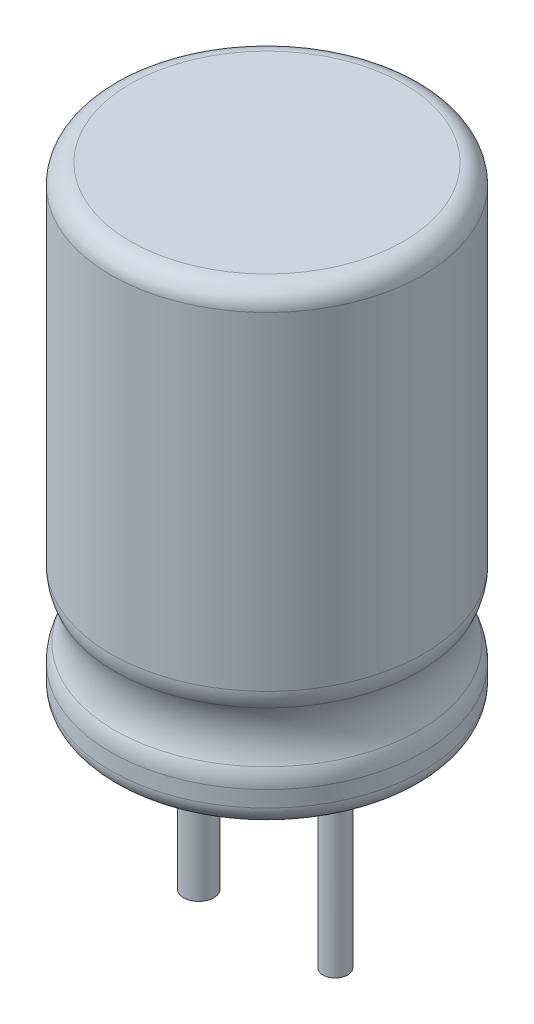
ISO-10303-21;
HEADER;
FILE_DESCRIPTION(('STEP AP214'),'2;1');
FILE_NAME('part.step','',(''),(''),'','','');
FILE_SCHEMA(('AUTOMOTIVE_DESIGN { 1 0 10303 214 1 1 1 1 }'));
ENDSEC;
DATA;
#1=APPLICATION_CONTEXT('core data for automotive mechanical design processes');
#2=APPLICATION_PROTOCOL_DEFINITION('international standard','automotive_design',2000,#1);
#3=PRODUCT_CONTEXT('',#1,'mechanical');
#4=PRODUCT('Part','Part','',(#3));
#5=PRODUCT_RELATED_PRODUCT_CATEGORY('part','',(#4));
#6=PRODUCT_DEFINITION_FORMATION('','',#4);
#7=PRODUCT_DEFINITION_CONTEXT('part definition',#1,'design');
#8=PRODUCT_DEFINITION('design','',#6,#7);
#9=PRODUCT_DEFINITION_SHAPE('','',#8);
#10=(LENGTH_UNIT() NAMED_UNIT(*) SI_UNIT(.MILLI.,.METRE.));
#11=(NAMED_UNIT(*) PLANE_ANGLE_UNIT() SI_UNIT($,.RADIAN.));
#12=(NAMED_UNIT(*) SI_UNIT($,.STERADIAN.) SOLID_ANGLE_UNIT());
#13=UNCERTAINTY_MEASURE_WITH_UNIT(LENGTH_MEASURE(1.E-05),#10,'distance_accuracy_value','');
#14=(GEOMETRIC_REPRESENTATION_CONTEXT(3) GLOBAL_UNCERTAINTY_ASSIGNED_CONTEXT((#13)) GLOBAL_UNIT_ASSIGNED_CONTEXT((#10,
#11,#12)) REPRESENTATION_CONTEXT('',''));
#15=CARTESIAN_POINT('',(0.,0.,0.));
#16=DIRECTION('',(0.,0.,1.));
#17=DIRECTION('',(1.,0.,0.));
#18=AXIS2_PLACEMENT_3D('',#15,#16,#17);
#19=CARTESIAN_POINT('',(0.,12.,0.));
#20=DIRECTION('',(0.,-1.,0.));
#21=DIRECTION('',(0.,0.,-1.));
#22=AXIS2_PLACEMENT_3D('',#19,#20,#21);
#23=CYLINDRICAL_SURFACE('',#22,4.);
#24=CARTESIAN_POINT('',(0.,0.5,0.));
#25=DIRECTION('',(0.,1.,0.));
#26=DIRECTION('',(0.,0.,1.));
#27=AXIS2_PLACEMENT_3D('',#24,#25,#26);
#28=CIRCLE('',#27,4.);
#29=CARTESIAN_POINT('',(0.,0.5,4.));
#30=VERTEX_POINT('',#29);
#31=EDGE_CURVE('E47',#30,#30,#28,.T.);
#32=ORIENTED_EDGE('',*,*,#31,.T.);
#33=EDGE_LOOP('',(#32));
#34=FACE_BOUND('',#33,.T.);
#35=CARTESIAN_POINT('',(0.,0.910275264114831,0.));
#36=DIRECTION('',(0.,-1.,0.));
#37=DIRECTION('',(0.,0.,-1.));
#38=AXIS2_PLACEMENT_3D('',#35,#36,#37);
#39=CIRCLE('',#38,4.);
#40=CARTESIAN_POINT('',(0.,0.910275264114831,-4.));
#41=VERTEX_POINT('',#40);
#42=EDGE_CURVE('E67',#41,#41,#39,.T.);
#43=ORIENTED_EDGE('',*,*,#42,.T.);
#44=EDGE_LOOP('',(#43));
#45=FACE_BOUND('',#44,.T.);
#46=ADVANCED_FACE('F39',(#34,#45),#23,.T.);
#47=CARTESIAN_POINT('',(0.,0.,0.));
#48=DIRECTION('',(0.,1.,0.));
#49=DIRECTION('',(0.,0.,1.));
#50=AXIS2_PLACEMENT_3D('',#47,#48,#49);
#51=PLANE('',#50);
#52=CARTESIAN_POINT('',(0.,0.,0.));
#53=DIRECTION('',(0.,1.,0.));
#54=DIRECTION('',(0.,0.,1.));
#55=AXIS2_PLACEMENT_3D('',#52,#53,#54);
#56=CIRCLE('',#55,3.5);
#57=CARTESIAN_POINT('',(0.,0.,3.5));
#58=VERTEX_POINT('',#57);
#59=EDGE_CURVE('E10',#58,#58,#56,.F.);
#60=ORIENTED_EDGE('',*,*,#59,.T.);
#61=EDGE_LOOP('',(#60));
#62=FACE_BOUND('',#61,.T.);
#63=CARTESIAN_POINT('',(-1.75,0.,0.));
#64=DIRECTION('',(0.,1.,0.));
#65=DIRECTION('',(0.,0.,1.));
#66=AXIS2_PLACEMENT_3D('',#63,#64,#65);
#67=CIRCLE('',#66,0.388464660860843);
#68=CARTESIAN_POINT('',(-1.75,0.,0.388464660860843));
#69=VERTEX_POINT('',#68);
#70=EDGE_CURVE('E79',#69,#69,#67,.F.);
#71=ORIENTED_EDGE('',*,*,#70,.F.);
#72=EDGE_LOOP('',(#71));
#73=FACE_BOUND('',#72,.T.);
#74=CARTESIAN_POINT('',(1.75,0.,0.));
#75=DIRECTION('',(0.,1.,0.));
#76=DIRECTION('',(0.,0.,1.));
#77=AXIS2_PLACEMENT_3D('',#74,#75,#76);
#78=CIRCLE('',#77,0.317566636794891);
#79=CARTESIAN_POINT('',(1.75,0.,0.317566636794891));
#80=VERTEX_POINT('',#79);
#81=EDGE_CURVE('E83',#80,#80,#78,.F.);
#82=ORIENTED_EDGE('',*,*,#81,.F.);
#83=EDGE_LOOP('',(#82));
#84=FACE_BOUND('',#83,.T.);
#85=ADVANCED_FACE('F105',(#62,#73,#84),#51,.F.);
#86=CARTESIAN_POINT('',(1.75,-5.,0.));
#87=DIRECTION('',(0.,1.,0.));
#88=DIRECTION('',(0.,0.,1.));
#89=AXIS2_PLACEMENT_3D('',#86,#87,#88);
#90=CYLINDRICAL_SURFACE('',#89,0.317566636794891);
#91=CARTESIAN_POINT('',(1.75,-5.,0.));
#92=DIRECTION('',(0.,-1.,0.));
#93=DIRECTION('',(0.,0.,-1.));
#94=AXIS2_PLACEMENT_3D('',#91,#92,#93);
#95=CIRCLE('',#94,0.317566636794891);
#96=CARTESIAN_POINT('',(1.75,-5.,-0.317566636794891));
#97=VERTEX_POINT('',#96);
#98=EDGE_CURVE('E87',#97,#97,#95,.T.);
#99=ORIENTED_EDGE('',*,*,#98,.F.);
#100=EDGE_LOOP('',(#99));
#101=FACE_BOUND('',#100,.T.);
#102=ORIENTED_EDGE('',*,*,#81,.T.);
#103=EDGE_LOOP('',(#102));
#104=FACE_BOUND('',#103,.T.);
#105=ADVANCED_FACE('F108',(#101,#104),#90,.T.);
#106=CARTESIAN_POINT('',(1.75,-5.,0.));
#107=DIRECTION('',(0.,-1.,0.));
#108=DIRECTION('',(0.,0.,-1.));
#109=AXIS2_PLACEMENT_3D('',#106,#107,#108);
#110=PLANE('',#109);
#111=ORIENTED_EDGE('',*,*,#98,.T.);
#112=EDGE_LOOP('',(#111));
#113=FACE_BOUND('',#112,.T.);
#114=ADVANCED_FACE('F101',(#113),#110,.T.);
#115=CARTESIAN_POINT('',(-1.75,-5.,0.));
#116=DIRECTION('',(0.,1.,0.));
#117=DIRECTION('',(0.,0.,1.));
#118=AXIS2_PLACEMENT_3D('',#115,#116,#117);
#119=CYLINDRICAL_SURFACE('',#118,0.388464660860843);
#120=CARTESIAN_POINT('',(-1.75,-5.,0.));
#121=DIRECTION('',(0.,-1.,0.));
#122=DIRECTION('',(0.,0.,-1.));
#123=AXIS2_PLACEMENT_3D('',#120,#121,#122);
#124=CIRCLE('',#123,0.388464660860843);
#125=CARTESIAN_POINT('',(-1.75,-5.,-0.388464660860843));
#126=VERTEX_POINT('',#125);
#127=EDGE_CURVE('E91',#126,#126,#124,.T.);
#128=ORIENTED_EDGE('',*,*,#127,.F.);
#129=EDGE_LOOP('',(#128));
#130=FACE_BOUND('',#129,.T.);
#131=ORIENTED_EDGE('',*,*,#70,.T.);
#132=EDGE_LOOP('',(#131));
#133=FACE_BOUND('',#132,.T.);
#134=ADVANCED_FACE('F98',(#130,#133),#119,.T.);
#135=CARTESIAN_POINT('',(-1.75,-5.,0.));
#136=DIRECTION('',(0.,-1.,0.));
#137=DIRECTION('',(0.,0.,-1.));
#138=AXIS2_PLACEMENT_3D('',#135,#136,#137);
#139=PLANE('',#138);
#140=ORIENTED_EDGE('',*,*,#127,.T.);
#141=EDGE_LOOP('',(#140));
#142=FACE_BOUND('',#141,.T.);
#143=ADVANCED_FACE('F96',(#142),#139,.T.);
#144=CARTESIAN_POINT('',(0.,2.,0.));
#145=DIRECTION('',(0.,1.,0.));
#146=DIRECTION('',(0.,0.,1.));
#147=AXIS2_PLACEMENT_3D('',#144,#145,#146);
#148=TOROIDAL_SURFACE('',#147,5.25,1.5);
#149=CARTESIAN_POINT('',(0.,1.3461651584689,0.));
#150=DIRECTION('',(0.,1.,0.));
#151=DIRECTION('',(0.,0.,1.));
#152=AXIS2_PLACEMENT_3D('',#149,#150,#151);
#153=CIRCLE('',#152,3.9);
#154=CARTESIAN_POINT('',(0.,1.3461651584689,3.9));
#155=VERTEX_POINT('',#154);
#156=EDGE_CURVE('E71',#155,#155,#153,.T.);
#157=ORIENTED_EDGE('',*,*,#156,.T.);
#158=EDGE_LOOP('',(#157));
#159=FACE_BOUND('',#158,.T.);
#160=CARTESIAN_POINT('',(0.,2.6538348415311,0.));
#161=DIRECTION('',(0.,-1.,0.));
#162=DIRECTION('',(0.,0.,-1.));
#163=AXIS2_PLACEMENT_3D('',#160,#161,#162);
#164=CIRCLE('',#163,3.9);
#165=CARTESIAN_POINT('',(0.,2.6538348415311,-3.9));
#166=VERTEX_POINT('',#165);
#167=EDGE_CURVE('E75',#166,#166,#164,.T.);
#168=ORIENTED_EDGE('',*,*,#167,.T.);
#169=EDGE_LOOP('',(#168));
#170=FACE_BOUND('',#169,.T.);
#171=ADVANCED_FACE('F139',(#159,#170),#148,.F.);
#172=CARTESIAN_POINT('',(0.,12.,0.));
#173=DIRECTION('',(0.,1.,0.));
#174=DIRECTION('',(0.,0.,1.));
#175=AXIS2_PLACEMENT_3D('',#172,#173,#174);
#176=PLANE('',#175);
#177=CARTESIAN_POINT('',(0.,12.,0.));
#178=DIRECTION('',(0.,1.,0.));
#179=DIRECTION('',(0.,0.,1.));
#180=AXIS2_PLACEMENT_3D('',#177,#178,#179);
#181=CIRCLE('',#180,3.5);
#182=CARTESIAN_POINT('',(0.,12.,3.5));
#183=VERTEX_POINT('',#182);
#184=EDGE_CURVE('E57',#183,#183,#181,.T.);
#185=ORIENTED_EDGE('',*,*,#184,.T.);
#186=EDGE_LOOP('',(#185));
#187=FACE_BOUND('',#186,.T.);
#188=ADVANCED_FACE('F131',(#187),#176,.T.);
#189=CARTESIAN_POINT('',(0.,11.5,0.));
#190=DIRECTION('',(0.,1.,0.));
#191=DIRECTION('',(0.,0.,1.));
#192=AXIS2_PLACEMENT_3D('',#189,#190,#191);
#193=CIRCLE('',#192,4.);
#194=CARTESIAN_POINT('',(0.,11.5,4.));
#195=VERTEX_POINT('',#194);
#196=EDGE_CURVE('E52',#195,#195,#193,.F.);
#197=ORIENTED_EDGE('',*,*,#196,.T.);
#198=EDGE_LOOP('',(#197));
#199=FACE_BOUND('',#198,.T.);
#200=CARTESIAN_POINT('',(0.,3.08972473588517,0.));
#201=DIRECTION('',(0.,1.,0.));
#202=DIRECTION('',(0.,0.,1.));
#203=AXIS2_PLACEMENT_3D('',#200,#201,#202);
#204=CIRCLE('',#203,4.);
#205=CARTESIAN_POINT('',(0.,3.08972473588517,4.));
#206=VERTEX_POINT('',#205);
#207=EDGE_CURVE('E63',#206,#206,#204,.T.);
#208=ORIENTED_EDGE('',*,*,#207,.T.);
#209=EDGE_LOOP('',(#208));
#210=FACE_BOUND('',#209,.T.);
#211=ADVANCED_FACE('F124',(#199,#210),#23,.T.);
#212=CARTESIAN_POINT('',(0.,0.910275264114831,0.));
#213=DIRECTION('',(0.,-1.,0.));
#214=DIRECTION('',(0.,0.,-1.));
#215=AXIS2_PLACEMENT_3D('',#212,#213,#214);
#216=TOROIDAL_SURFACE('',#215,3.,1.);
#217=ORIENTED_EDGE('',*,*,#42,.F.);
#218=EDGE_LOOP('',(#217));
#219=FACE_BOUND('',#218,.T.);
#220=ORIENTED_EDGE('',*,*,#156,.F.);
#221=EDGE_LOOP('',(#220));
#222=FACE_BOUND('',#221,.T.);
#223=ADVANCED_FACE('F130',(#219,#222),#216,.T.);
#224=CARTESIAN_POINT('',(0.,3.08972473588517,0.));
#225=DIRECTION('',(0.,1.,0.));
#226=DIRECTION('',(0.,0.,1.));
#227=AXIS2_PLACEMENT_3D('',#224,#225,#226);
#228=TOROIDAL_SURFACE('',#227,3.,1.);
#229=ORIENTED_EDGE('',*,*,#207,.F.);
#230=EDGE_LOOP('',(#229));
#231=FACE_BOUND('',#230,.T.);
#232=ORIENTED_EDGE('',*,*,#167,.F.);
#233=EDGE_LOOP('',(#232));
#234=FACE_BOUND('',#233,.T.);
#235=ADVANCED_FACE('F137',(#231,#234),#228,.T.);
#236=CARTESIAN_POINT('',(0.,11.5,0.));
#237=DIRECTION('',(0.,1.,0.));
#238=DIRECTION('',(0.,0.,1.));
#239=AXIS2_PLACEMENT_3D('',#236,#237,#238);
#240=TOROIDAL_SURFACE('',#239,3.5,0.5);
#241=ORIENTED_EDGE('',*,*,#196,.F.);
#242=EDGE_LOOP('',(#241));
#243=FACE_BOUND('',#242,.T.);
#244=ORIENTED_EDGE('',*,*,#184,.F.);
#245=EDGE_LOOP('',(#244));
#246=FACE_BOUND('',#245,.T.);
#247=ADVANCED_FACE('F147',(#243,#246),#240,.T.);
#248=CARTESIAN_POINT('',(0.,0.5,0.));
#249=DIRECTION('',(0.,1.,0.));
#250=DIRECTION('',(0.,0.,1.));
#251=AXIS2_PLACEMENT_3D('',#248,#249,#250);
#252=TOROIDAL_SURFACE('',#251,3.5,0.5);
#253=ORIENTED_EDGE('',*,*,#59,.F.);
#254=EDGE_LOOP('',(#253));
#255=FACE_BOUND('',#254,.T.);
#256=ORIENTED_EDGE('',*,*,#31,.F.);
#257=EDGE_LOOP('',(#256));
#258=FACE_BOUND('',#257,.T.);
#259=ADVANCED_FACE('F41',(#255,#258),#252,.T.);
#260=CLOSED_SHELL('',(#46,#85,#105,#114,#134,#143,#171,#188,#211,#223,#235,#247,#259));
#261=MANIFOLD_SOLID_BREP('B2',#260);
#262=ADVANCED_BREP_SHAPE_REPRESENTATION('',(#18,#261),#14);
#263=SHAPE_DEFINITION_REPRESENTATION(#9,#262);
ENDSEC;
END-ISO-10303-21;
